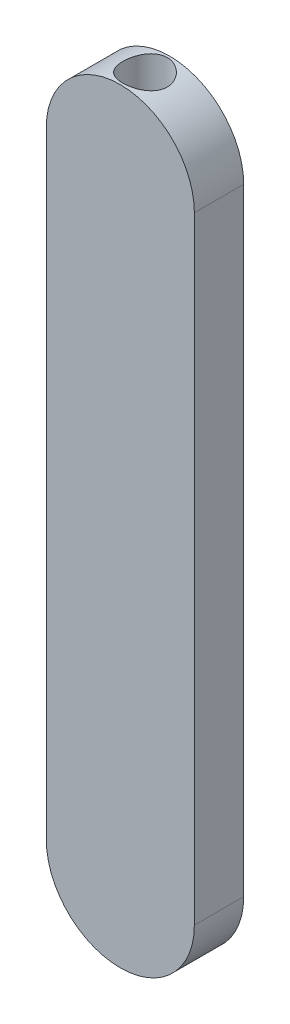
ISO-10303-21;
HEADER;
FILE_DESCRIPTION(('STEP AP214'),'2;1');
FILE_NAME('part.step','',(''),(''),'','','');
FILE_SCHEMA(('AUTOMOTIVE_DESIGN { 1 0 10303 214 1 1 1 1 }'));
ENDSEC;
DATA;
#1=APPLICATION_CONTEXT('core data for automotive mechanical design processes');
#2=APPLICATION_PROTOCOL_DEFINITION('international standard','automotive_design',2000,#1);
#3=PRODUCT_CONTEXT('',#1,'mechanical');
#4=PRODUCT('Part','Part','',(#3));
#5=PRODUCT_RELATED_PRODUCT_CATEGORY('part','',(#4));
#6=PRODUCT_DEFINITION_FORMATION('','',#4);
#7=PRODUCT_DEFINITION_CONTEXT('part definition',#1,'design');
#8=PRODUCT_DEFINITION('design','',#6,#7);
#9=PRODUCT_DEFINITION_SHAPE('','',#8);
#10=(LENGTH_UNIT() NAMED_UNIT(*) SI_UNIT(.MILLI.,.METRE.));
#11=(NAMED_UNIT(*) PLANE_ANGLE_UNIT() SI_UNIT($,.RADIAN.));
#12=(NAMED_UNIT(*) SI_UNIT($,.STERADIAN.) SOLID_ANGLE_UNIT());
#13=UNCERTAINTY_MEASURE_WITH_UNIT(LENGTH_MEASURE(1.E-05),#10,'distance_accuracy_value','');
#14=(GEOMETRIC_REPRESENTATION_CONTEXT(3) GLOBAL_UNCERTAINTY_ASSIGNED_CONTEXT((#13)) GLOBAL_UNIT_ASSIGNED_CONTEXT((#10,
#11,#12)) REPRESENTATION_CONTEXT('',''));
#15=CARTESIAN_POINT('',(0.,0.,0.));
#16=DIRECTION('',(0.,0.,1.));
#17=DIRECTION('',(1.,0.,0.));
#18=AXIS2_PLACEMENT_3D('',#15,#16,#17);
#19=CARTESIAN_POINT('',(0.,125.,10.));
#20=DIRECTION('',(0.,0.,-1.));
#21=DIRECTION('',(-1.,0.,0.));
#22=AXIS2_PLACEMENT_3D('',#19,#20,#21);
#23=CYLINDRICAL_SURFACE('',#22,30.);
#24=CARTESIAN_POINT('',(0.,125.,-10.));
#25=DIRECTION('',(0.,0.,1.));
#26=DIRECTION('',(1.,0.,0.));
#27=AXIS2_PLACEMENT_3D('',#24,#25,#26);
#28=CIRCLE('',#27,30.);
#29=CARTESIAN_POINT('',(30.,125.,-10.));
#30=VERTEX_POINT('',#29);
#31=CARTESIAN_POINT('',(-30.,125.,-10.));
#32=VERTEX_POINT('',#31);
#33=EDGE_CURVE('E120',#30,#32,#28,.T.);
#34=ORIENTED_EDGE('',*,*,#33,.T.);
#35=DIRECTION('',(0.,0.,-1.));
#36=VECTOR('',#35,1.);
#37=CARTESIAN_POINT('',(-30.,125.,10.));
#38=LINE('',#37,#36);
#39=CARTESIAN_POINT('',(-30.,125.,10.));
#40=VERTEX_POINT('',#39);
#41=EDGE_CURVE('E11',#40,#32,#38,.T.);
#42=ORIENTED_EDGE('',*,*,#41,.F.);
#43=CARTESIAN_POINT('',(0.,125.,10.));
#44=DIRECTION('',(0.,0.,1.));
#45=DIRECTION('',(1.,0.,0.));
#46=AXIS2_PLACEMENT_3D('',#43,#44,#45);
#47=CIRCLE('',#46,30.);
#48=CARTESIAN_POINT('',(30.,125.,10.));
#49=VERTEX_POINT('',#48);
#50=EDGE_CURVE('E103',#49,#40,#47,.T.);
#51=ORIENTED_EDGE('',*,*,#50,.F.);
#52=DIRECTION('',(0.,0.,-1.));
#53=VECTOR('',#52,1.);
#54=CARTESIAN_POINT('',(30.,125.,10.));
#55=LINE('',#54,#53);
#56=EDGE_CURVE('E116',#49,#30,#55,.T.);
#57=ORIENTED_EDGE('',*,*,#56,.T.);
#58=EDGE_LOOP('',(#34,#42,#51,#57));
#59=FACE_BOUND('',#58,.T.);
#60=CARTESIAN_POINT('',(0.,155.,-9.));
#61=CARTESIAN_POINT('',(-0.24687522719446,154.999999690804,-8.99999951926633));
#62=CARTESIAN_POINT('',(-0.493758933697373,154.996945376263,-8.98983373748947));
#63=CARTESIAN_POINT('',(-0.98571331633545,154.984811532503,-8.94926216676299));
#64=CARTESIAN_POINT('',(-1.23078390923342,154.975731728377,-8.91885545434272));
#65=CARTESIAN_POINT('',(-1.71734028727223,154.951795867524,-8.83807456534316));
#66=CARTESIAN_POINT('',(-1.95882582561324,154.936939415023,-8.78769902063548));
#67=CARTESIAN_POINT('',(-2.43656882894963,154.901848221789,-8.6674006880664));
#68=CARTESIAN_POINT('',(-2.67282432501111,154.881611491648,-8.59747066925435));
#69=CARTESIAN_POINT('',(-3.13795593973207,154.836349231097,-8.43880923337498));
#70=CARTESIAN_POINT('',(-3.36684511034698,154.81133278546,-8.3501134504766));
#71=CARTESIAN_POINT('',(-3.81629034248756,154.75713676916,-8.15450908614894));
#72=CARTESIAN_POINT('',(-4.03684323307769,154.727955634102,-8.04759365788162));
#73=CARTESIAN_POINT('',(-4.46806405999108,154.666206974297,-7.81640810530772));
#74=CARTESIAN_POINT('',(-4.67873511836349,154.633640529701,-7.69214351228128));
#75=CARTESIAN_POINT('',(-5.08907702569748,154.565935870264,-7.4270444928224));
#76=CARTESIAN_POINT('',(-5.28874277096538,154.530796479525,-7.28620247200257));
#77=CARTESIAN_POINT('',(-5.68079175811243,154.457925648759,-6.98507469473938));
#78=CARTESIAN_POINT('',(-5.87285312608399,154.420150676386,-6.82438029337194));
#79=CARTESIAN_POINT('',(-6.24276841718318,154.343883516478,-6.48770874739904));
#80=CARTESIAN_POINT('',(-6.42062827839696,154.305391637095,-6.31173805520373));
#81=CARTESIAN_POINT('',(-6.76121495469285,154.228692527664,-5.94546427637099));
#82=CARTESIAN_POINT('',(-6.92393310779204,154.190485471909,-5.75515309738337));
#83=CARTESIAN_POINT('',(-7.23301044029676,154.115440036366,-5.36154377643514));
#84=CARTESIAN_POINT('',(-7.37937568089396,154.078601152869,-5.15825049048207));
#85=CARTESIAN_POINT('',(-7.65798662555216,154.006489411854,-4.73506885570751));
#86=CARTESIAN_POINT('',(-7.78983133985887,153.971271875173,-4.51490677567574));
#87=CARTESIAN_POINT('',(-8.03438843056108,153.904405819866,-4.06379176598789));
#88=CARTESIAN_POINT('',(-8.14710828969498,153.872755907015,-3.83284310197441));
#89=CARTESIAN_POINT('',(-8.3525651866136,153.813991056005,-3.36165307045628));
#90=CARTESIAN_POINT('',(-8.44530186155833,153.786876200192,-3.12141153431188));
#91=CARTESIAN_POINT('',(-8.6099761042191,153.738053121907,-2.63336852321781));
#92=CARTESIAN_POINT('',(-8.68191441283536,153.716344706847,-2.38556731791398));
#93=CARTESIAN_POINT('',(-8.80260979417984,153.679573408675,-1.89128494977476));
#94=CARTESIAN_POINT('',(-8.85195939944504,153.664341510447,-1.64496100852945));
#95=CARTESIAN_POINT('',(-8.92991899386314,153.640150467133,-1.14874635011902));
#96=CARTESIAN_POINT('',(-8.958529337725,153.631191214764,-0.898855694030882));
#97=CARTESIAN_POINT('',(-8.99473123894795,153.619838773049,-0.397460111825584));
#98=CARTESIAN_POINT('',(-9.00232721556962,153.617444203171,-0.145955536263609));
#99=CARTESIAN_POINT('',(-8.99643811389517,153.619296153187,0.356779194810821));
#100=CARTESIAN_POINT('',(-8.98295349026987,153.623542529847,0.60800935612495));
#101=CARTESIAN_POINT('',(-8.93590903357945,153.638262955357,1.09916630378445));
#102=CARTESIAN_POINT('',(-8.90309651768086,153.648505090203,1.33917208915314));
#103=CARTESIAN_POINT('',(-8.81829693839761,153.674720691197,1.81554089014339));
#104=CARTESIAN_POINT('',(-8.7663030429288,153.69069619942,2.05190257650946));
#105=CARTESIAN_POINT('',(-8.64359525627879,153.727902191809,2.51925058342802));
#106=CARTESIAN_POINT('',(-8.5728840047393,153.749131934961,2.75023765694972));
#107=CARTESIAN_POINT('',(-8.41330748035027,153.796235375053,3.20537304493311));
#108=CARTESIAN_POINT('',(-8.32444120493493,153.822109328448,3.42952098093452));
#109=CARTESIAN_POINT('',(-8.12789997921522,153.878154720427,3.8725664168717));
#110=CARTESIAN_POINT('',(-8.01998497142832,153.908379971791,4.09135056999753));
#111=CARTESIAN_POINT('',(-7.78698416863509,153.972011583606,4.51909231090593));
#112=CARTESIAN_POINT('',(-7.66189790363685,154.005418031121,4.72804962950943));
#113=CARTESIAN_POINT('',(-7.39538391059137,154.074511931035,5.13492478845818));
#114=CARTESIAN_POINT('',(-7.25395309727253,154.110199813518,5.33284053405679));
#115=CARTESIAN_POINT('',(-6.95567501480212,154.182908431969,5.71643405375052));
#116=CARTESIAN_POINT('',(-6.79882730322162,154.219929206168,5.90211147637878));
#117=CARTESIAN_POINT('',(-6.46380880146505,154.295902260877,6.26762912592172));
#118=CARTESIAN_POINT('',(-6.28502066721601,154.334870581416,6.44690070087367));
#119=CARTESIAN_POINT('',(-5.91290332936832,154.412134875664,6.78981528813084));
#120=CARTESIAN_POINT('',(-5.71957407379525,154.45043084697,6.95345824456986));
#121=CARTESIAN_POINT('',(-5.3195794785746,154.525302203701,7.26403410984884));
#122=CARTESIAN_POINT('',(-5.11291276619929,154.561877411348,7.41096529435441));
#123=CARTESIAN_POINT('',(-4.6875944702094,154.632295088259,7.68704973774021));
#124=CARTESIAN_POINT('',(-4.46894340179161,154.666137674842,7.81620376000803));
#125=CARTESIAN_POINT('',(-4.01951930468406,154.730377401638,8.05660330017718));
#126=CARTESIAN_POINT('',(-3.78867237370753,154.760748868096,8.16771764646381));
#127=CARTESIAN_POINT('',(-3.31796148225631,154.816895892795,8.369989427077));
#128=CARTESIAN_POINT('',(-3.07810121716819,154.842673310192,8.46115493786864));
#129=CARTESIAN_POINT('',(-2.59100646332482,154.888903081017,8.62279127227451));
#130=CARTESIAN_POINT('',(-2.34377211625549,154.909355536687,8.69326249322791));
#131=CARTESIAN_POINT('',(-1.84378416239139,154.944335848342,8.8128613614019));
#132=CARTESIAN_POINT('',(-1.59103075750432,154.958863920681,8.86198978805205));
#133=CARTESIAN_POINT('',(-1.09110687447902,154.981157940997,8.9370613874282));
#134=CARTESIAN_POINT('',(-0.844061604560787,154.989147872582,8.96377341231346));
#135=CARTESIAN_POINT('',(-0.348488409261118,154.998999493918,8.99667826532353));
#136=CARTESIAN_POINT('',(-0.0999605195231613,155.000861330404,9.0028715847604));
#137=CARTESIAN_POINT('',(0.396693900528415,154.998404909285,8.9946823962975));
#138=CARTESIAN_POINT('',(0.644820475666576,154.994087397612,8.98030237187826));
#139=CARTESIAN_POINT('',(1.13885569360233,154.97939423655,8.93110458913962));
#140=CARTESIAN_POINT('',(1.38476435207486,154.96901863001,8.89628697537629));
#141=CARTESIAN_POINT('',(1.86699068629302,154.942800902787,8.80755783222827));
#142=CARTESIAN_POINT('',(2.10339917366125,154.927088920447,8.75410012033345));
#143=CARTESIAN_POINT('',(2.57085342622231,154.890562008373,8.62840150170935));
#144=CARTESIAN_POINT('',(2.80189723737997,154.869745250226,8.55615386429563));
#145=CARTESIAN_POINT('',(3.25694777313326,154.823557533001,8.39348911553929));
#146=CARTESIAN_POINT('',(3.4809564814769,154.798187871541,8.30307718030838));
#147=CARTESIAN_POINT('',(3.9206735334169,154.743527531497,8.10472197538234));
#148=CARTESIAN_POINT('',(4.13637865624372,154.714235350799,7.99677198616619));
#149=CARTESIAN_POINT('',(4.56288021690551,154.651772756751,7.76149330417735));
#150=CARTESIAN_POINT('',(4.77345386566451,154.618529364886,7.63378013243341));
#151=CARTESIAN_POINT('',(5.1832482000316,154.549570858058,7.36168864950443));
#152=CARTESIAN_POINT('',(5.38246373149598,154.513854636987,7.21730286104145));
#153=CARTESIAN_POINT('',(5.76824209562065,154.440888680009,6.91286909678906));
#154=CARTESIAN_POINT('',(5.95480494100446,154.403638945643,6.75282113674989));
#155=CARTESIAN_POINT('',(6.31416336644096,154.328570417492,6.41807164510148));
#156=CARTESIAN_POINT('',(6.48695868128923,154.290751612762,6.24336983134755));
#157=CARTESIAN_POINT('',(6.82378475322263,154.214155429841,5.87373335172453));
#158=CARTESIAN_POINT('',(6.98726403029261,154.175393563162,5.67829245590589));
#159=CARTESIAN_POINT('',(7.29714192683922,154.099435878477,5.27413861942092));
#160=CARTESIAN_POINT('',(7.44354675134784,154.062239494719,5.06543054305524));
#161=CARTESIAN_POINT('',(7.71836315758023,153.9904649038,4.63593471765456));
#162=CARTESIAN_POINT('',(7.84676762786344,153.955887733883,4.41514224203838));
#163=CARTESIAN_POINT('',(8.08449235365031,153.890416862031,3.96310073693768));
#164=CARTESIAN_POINT('',(8.19382047882574,153.859521642836,3.73185606916012));
#165=CARTESIAN_POINT('',(8.39212213615004,153.802480643849,3.26146280739651));
#166=CARTESIAN_POINT('',(8.48118472093344,153.776314193186,3.02235429420191));
#167=CARTESIAN_POINT('',(8.63880815166785,153.729388515714,2.53694818381532));
#168=CARTESIAN_POINT('',(8.70736898436385,153.708629292401,2.29065058197546));
#169=CARTESIAN_POINT('',(8.82333878587885,153.67319958287,1.79276527738367));
#170=CARTESIAN_POINT('',(8.8707538278203,153.658527348538,1.54117911528366));
#171=CARTESIAN_POINT('',(8.94399853503101,153.635753328123,1.03459227418198));
#172=CARTESIAN_POINT('',(8.96982902277117,153.627651291686,0.779591725660376));
#173=CARTESIAN_POINT('',(8.99902686177176,153.618485863641,0.27886553863208));
#174=CARTESIAN_POINT('',(9.00328608012112,153.61714302695,0.03319659601729));
#175=CARTESIAN_POINT('',(8.99170957250374,153.620782612131,-0.457615566175719));
#176=CARTESIAN_POINT('',(8.97587443373626,153.62576484917,-0.702758800906539));
#177=CARTESIAN_POINT('',(8.92425831634993,153.641898343331,-1.19071618682869));
#178=CARTESIAN_POINT('',(8.88847824348013,153.653049320315,-1.4335304432754));
#179=CARTESIAN_POINT('',(8.79729759590076,153.681175475724,-1.91510106215879));
#180=CARTESIAN_POINT('',(8.74189693009455,153.698150681189,-2.15385740574956));
#181=CARTESIAN_POINT('',(8.61278136684695,153.737161994499,-2.62266336729945));
#182=CARTESIAN_POINT('',(8.53930707566763,153.759131347168,-2.85278492785691));
#183=CARTESIAN_POINT('',(8.37426393967971,153.807622213489,-3.30603927141137));
#184=CARTESIAN_POINT('',(8.28268862083896,153.834145355408,-3.52916952071281));
#185=CARTESIAN_POINT('',(8.08215610506225,153.890995244476,-3.96695328366282));
#186=CARTESIAN_POINT('',(7.97319984049174,153.921321787581,-4.18160725123416));
#187=CARTESIAN_POINT('',(7.73866416062295,153.984958783846,-4.60117873107889));
#188=CARTESIAN_POINT('',(7.61308375480259,154.01826941477,-4.80609566219755));
#189=CARTESIAN_POINT('',(7.34126486815788,154.088248997366,-5.21226415946834));
#190=CARTESIAN_POINT('',(7.19444058113146,154.124996076204,-5.41311041005077));
#191=CARTESIAN_POINT('',(6.8848048622528,154.199740080473,-5.80182818742272));
#192=CARTESIAN_POINT('',(6.72199309309908,154.237737032263,-5.98969944032521));
#193=CARTESIAN_POINT('',(6.38137449598392,154.313964546973,-6.35136039376972));
#194=CARTESIAN_POINT('',(6.20356384484473,154.352195167138,-6.5251464817687));
#195=CARTESIAN_POINT('',(5.8340876381612,154.427860521655,-6.8574895356109));
#196=CARTESIAN_POINT('',(5.64242232618264,154.465295269984,-7.01604676906422));
#197=CARTESIAN_POINT('',(5.24055724419363,154.539456998815,-7.3213452270685));
#198=CARTESIAN_POINT('',(5.02997746430738,154.576130506387,-7.46759977741498));
#199=CARTESIAN_POINT('',(4.59683195296546,154.646538636923,-7.74175722586798));
#200=CARTESIAN_POINT('',(4.37427060922232,154.680274324043,-7.86966677997631));
#201=CARTESIAN_POINT('',(3.91863702485825,154.743859520223,-8.10618008273968));
#202=CARTESIAN_POINT('',(3.68556689736798,154.773709805919,-8.21478769116109));
#203=CARTESIAN_POINT('',(3.21051695796145,154.8286729272,-8.41181832037685));
#204=CARTESIAN_POINT('',(2.96853800844563,154.853786219907,-8.50024328897563));
#205=CARTESIAN_POINT('',(2.50382115734948,154.89614249473,-8.64776090442864));
#206=CARTESIAN_POINT('',(2.28180743967457,154.913941034826,-8.70898372495703));
#207=CARTESIAN_POINT('',(1.83334279623095,154.944772103142,-8.81430188411468));
#208=CARTESIAN_POINT('',(1.60689045524053,154.957803084336,-8.85839166352448));
#209=CARTESIAN_POINT('',(1.15106718653289,154.97877731236,-8.92906654858351));
#210=CARTESIAN_POINT('',(0.921696658553534,154.986721248529,-8.95565402596193));
#211=CARTESIAN_POINT('',(0.461552874118431,154.997331805047,-8.99111784909154));
#212=CARTESIAN_POINT('',(0.230780141923343,155.000000289037,-9.00000044939213));
#213=CARTESIAN_POINT('',(0.,155.,-9.));
#214=B_SPLINE_CURVE_WITH_KNOTS('',3,(#60,#61,#62,#63,#64,#65,#66,#67,#68,#69,#70,#71,#72,#73,
#74,#75,#76,#77,#78,#79,#80,#81,#82,#83,#84,#85,#86,#87,#88,#89,#90,#91,#92,#93,#94,#95,#96,#97,
#98,#99,#100,#101,#102,#103,#104,#105,#106,#107,#108,#109,#110,#111,#112,#113,#114,#115,#116,
#117,#118,#119,#120,#121,#122,#123,#124,#125,#126,#127,#128,#129,#130,#131,#132,#133,#134,#135,
#136,#137,#138,#139,#140,#141,#142,#143,#144,#145,#146,#147,#148,#149,#150,#151,#152,#153,#154,
#155,#156,#157,#158,#159,#160,#161,#162,#163,#164,#165,#166,#167,#168,#169,#170,#171,#172,#173,
#174,#175,#176,#177,#178,#179,#180,#181,#182,#183,#184,#185,#186,#187,#188,#189,#190,#191,#192,
#193,#194,#195,#196,#197,#198,#199,#200,#201,#202,#203,#204,#205,#206,#207,#208,#209,#210,#211,
#212,#213),.UNSPECIFIED.,.T.,.F.,(4,2,2,2,2,2,2,2,2,2,2,2,2,2,2,2,2,2,2,2,2,2,2,2,2,2,2,2,2,2,2,
2,2,2,2,2,2,2,2,2,2,2,2,2,2,2,2,2,2,2,2,2,2,2,2,2,2,2,2,2,2,2,2,2,2,2,2,2,2,2,2,2,2,2,2,2,4),
(0.,0.740413216901878,1.4808602166743,2.22135795560235,2.96212988240107,3.70150758898388,
4.44116376467173,5.18058465858264,5.92034562132776,6.67923780992289,7.4378110023569,
8.19681551108569,8.95553775562747,9.73166741230633,10.507492698835,11.2833320710433,
12.0591438021185,12.8132385740861,13.5673204482712,14.321243729163,15.0751507495034,
15.8016616365828,16.5284315448307,17.2550990138762,17.9818066221682,18.7184283271017,
19.4550701980193,20.1918513486502,20.9286536493539,21.6962623628207,22.4638738200863,
23.2315644084216,23.9992220202666,24.7722331237348,25.5449306852944,26.3176134097617,
27.0902679138193,27.8351912450428,28.5800967392512,29.32491232089,30.0697226344752,
30.797537709847,31.5256138536762,32.2534828179172,32.9816313180365,33.7263192489373,
34.4713424616101,35.2163649250774,35.9614017364707,36.7336800097587,37.5056767488153,
38.2779776279686,39.0499591483441,39.8184798678771,40.5870010842806,41.3553014371578,
42.1235725129188,42.8598040112379,43.5960139958236,44.3321905500058,45.0683705222341,
45.7952353579563,46.5223606368482,47.2494469236927,47.9765765522915,48.7301889381114,
49.483817226949,50.2376381976291,50.9914459193129,51.7674951526374,52.5432621006114,
53.3188737452504,54.0944105047804,54.7866663836971,55.4791466941857,56.1715331476467,
56.8636749604173),.UNSPECIFIED.);
#215=CARTESIAN_POINT('',(0.,155.,-9.));
#216=VERTEX_POINT('',#215);
#217=EDGE_CURVE('E49',#216,#216,#214,.T.);
#218=ORIENTED_EDGE('',*,*,#217,.F.);
#219=EDGE_LOOP('',(#218));
#220=FACE_BOUND('',#219,.T.);
#221=ADVANCED_FACE('F45',(#59,#220),#23,.T.);
#222=CARTESIAN_POINT('',(-30.,-125.,10.));
#223=DIRECTION('',(1.,0.,0.));
#224=DIRECTION('',(0.,0.,-1.));
#225=AXIS2_PLACEMENT_3D('',#222,#223,#224);
#226=PLANE('',#225);
#227=DIRECTION('',(0.,-1.,0.));
#228=VECTOR('',#227,1.);
#229=CARTESIAN_POINT('',(-30.,-125.,-10.));
#230=LINE('',#229,#228);
#231=CARTESIAN_POINT('',(-30.,-125.,-10.));
#232=VERTEX_POINT('',#231);
#233=EDGE_CURVE('E108',#32,#232,#230,.T.);
#234=ORIENTED_EDGE('',*,*,#233,.T.);
#235=DIRECTION('',(0.,0.,-1.));
#236=VECTOR('',#235,1.);
#237=CARTESIAN_POINT('',(-30.,-125.,10.));
#238=LINE('',#237,#236);
#239=CARTESIAN_POINT('',(-30.,-125.,10.));
#240=VERTEX_POINT('',#239);
#241=EDGE_CURVE('E60',#240,#232,#238,.T.);
#242=ORIENTED_EDGE('',*,*,#241,.F.);
#243=DIRECTION('',(0.,-1.,0.));
#244=VECTOR('',#243,1.);
#245=CARTESIAN_POINT('',(-30.,-125.,10.));
#246=LINE('',#245,#244);
#247=EDGE_CURVE('E98',#40,#240,#246,.T.);
#248=ORIENTED_EDGE('',*,*,#247,.F.);
#249=ORIENTED_EDGE('',*,*,#41,.T.);
#250=EDGE_LOOP('',(#234,#242,#248,#249));
#251=FACE_BOUND('',#250,.T.);
#252=ADVANCED_FACE('F107',(#251),#226,.F.);
#253=CARTESIAN_POINT('',(0.,-125.,10.));
#254=DIRECTION('',(0.,0.,-1.));
#255=DIRECTION('',(-1.,0.,0.));
#256=AXIS2_PLACEMENT_3D('',#253,#254,#255);
#257=CYLINDRICAL_SURFACE('',#256,30.);
#258=CARTESIAN_POINT('',(0.,-125.,-10.));
#259=DIRECTION('',(0.,0.,1.));
#260=DIRECTION('',(1.,0.,0.));
#261=AXIS2_PLACEMENT_3D('',#258,#259,#260);
#262=CIRCLE('',#261,30.);
#263=CARTESIAN_POINT('',(30.,-125.,-10.));
#264=VERTEX_POINT('',#263);
#265=EDGE_CURVE('E85',#232,#264,#262,.T.);
#266=ORIENTED_EDGE('',*,*,#265,.T.);
#267=DIRECTION('',(0.,0.,-1.));
#268=VECTOR('',#267,1.);
#269=CARTESIAN_POINT('',(30.,-125.,10.));
#270=LINE('',#269,#268);
#271=CARTESIAN_POINT('',(30.,-125.,10.));
#272=VERTEX_POINT('',#271);
#273=EDGE_CURVE('E110',#272,#264,#270,.T.);
#274=ORIENTED_EDGE('',*,*,#273,.F.);
#275=CARTESIAN_POINT('',(0.,-125.,10.));
#276=DIRECTION('',(0.,0.,1.));
#277=DIRECTION('',(1.,0.,0.));
#278=AXIS2_PLACEMENT_3D('',#275,#276,#277);
#279=CIRCLE('',#278,30.);
#280=EDGE_CURVE('E101',#240,#272,#279,.T.);
#281=ORIENTED_EDGE('',*,*,#280,.F.);
#282=ORIENTED_EDGE('',*,*,#241,.T.);
#283=EDGE_LOOP('',(#266,#274,#281,#282));
#284=FACE_BOUND('',#283,.T.);
#285=ADVANCED_FACE('F112',(#284),#257,.T.);
#286=CARTESIAN_POINT('',(30.,-125.,10.));
#287=DIRECTION('',(-1.,0.,0.));
#288=DIRECTION('',(0.,0.,1.));
#289=AXIS2_PLACEMENT_3D('',#286,#287,#288);
#290=PLANE('',#289);
#291=DIRECTION('',(0.,1.,0.));
#292=VECTOR('',#291,1.);
#293=CARTESIAN_POINT('',(30.,-125.,-10.));
#294=LINE('',#293,#292);
#295=EDGE_CURVE('E91',#264,#30,#294,.T.);
#296=ORIENTED_EDGE('',*,*,#295,.T.);
#297=ORIENTED_EDGE('',*,*,#56,.F.);
#298=DIRECTION('',(0.,1.,0.));
#299=VECTOR('',#298,1.);
#300=CARTESIAN_POINT('',(30.,-125.,10.));
#301=LINE('',#300,#299);
#302=EDGE_CURVE('E68',#272,#49,#301,.T.);
#303=ORIENTED_EDGE('',*,*,#302,.F.);
#304=ORIENTED_EDGE('',*,*,#273,.T.);
#305=EDGE_LOOP('',(#296,#297,#303,#304));
#306=FACE_BOUND('',#305,.T.);
#307=ADVANCED_FACE('F133',(#306),#290,.F.);
#308=CARTESIAN_POINT('',(0.,125.,10.));
#309=DIRECTION('',(0.,0.,1.));
#310=DIRECTION('',(1.,0.,0.));
#311=AXIS2_PLACEMENT_3D('',#308,#309,#310);
#312=PLANE('',#311);
#313=ORIENTED_EDGE('',*,*,#50,.T.);
#314=ORIENTED_EDGE('',*,*,#247,.T.);
#315=ORIENTED_EDGE('',*,*,#280,.T.);
#316=ORIENTED_EDGE('',*,*,#302,.T.);
#317=EDGE_LOOP('',(#313,#314,#315,#316));
#318=FACE_BOUND('',#317,.T.);
#319=ADVANCED_FACE('F99',(#318),#312,.T.);
#320=CARTESIAN_POINT('',(0.,125.,-10.));
#321=DIRECTION('',(0.,0.,1.));
#322=DIRECTION('',(1.,0.,0.));
#323=AXIS2_PLACEMENT_3D('',#320,#321,#322);
#324=PLANE('',#323);
#325=ORIENTED_EDGE('',*,*,#33,.F.);
#326=ORIENTED_EDGE('',*,*,#295,.F.);
#327=ORIENTED_EDGE('',*,*,#265,.F.);
#328=ORIENTED_EDGE('',*,*,#233,.F.);
#329=EDGE_LOOP('',(#325,#326,#327,#328));
#330=FACE_BOUND('',#329,.T.);
#331=ADVANCED_FACE('F136',(#330),#324,.F.);
#332=CARTESIAN_POINT('',(0.,165.,0.));
#333=DIRECTION('',(0.,-1.,0.));
#334=DIRECTION('',(0.,0.,-1.));
#335=AXIS2_PLACEMENT_3D('',#332,#333,#334);
#336=CYLINDRICAL_SURFACE('',#335,9.);
#337=CARTESIAN_POINT('',(0.,125.,0.));
#338=DIRECTION('',(0.,1.,0.));
#339=DIRECTION('',(0.,0.,1.));
#340=AXIS2_PLACEMENT_3D('',#337,#338,#339);
#341=CIRCLE('',#340,9.);
#342=CARTESIAN_POINT('',(0.,125.,9.));
#343=VERTEX_POINT('',#342);
#344=EDGE_CURVE('E141',#343,#343,#341,.T.);
#345=ORIENTED_EDGE('',*,*,#344,.F.);
#346=EDGE_LOOP('',(#345));
#347=FACE_BOUND('',#346,.T.);
#348=ORIENTED_EDGE('',*,*,#217,.T.);
#349=EDGE_LOOP('',(#348));
#350=FACE_BOUND('',#349,.T.);
#351=ADVANCED_FACE('F150',(#347,#350),#336,.F.);
#352=CARTESIAN_POINT('',(0.,125.,0.));
#353=DIRECTION('',(0.,1.,0.));
#354=DIRECTION('',(0.,0.,1.));
#355=AXIS2_PLACEMENT_3D('',#352,#353,#354);
#356=PLANE('',#355);
#357=ORIENTED_EDGE('',*,*,#344,.T.);
#358=EDGE_LOOP('',(#357));
#359=FACE_BOUND('',#358,.T.);
#360=ADVANCED_FACE('F168',(#359),#356,.T.);
#361=CLOSED_SHELL('',(#221,#252,#285,#307,#319,#331,#351,#360));
#362=MANIFOLD_SOLID_BREP('B2',#361);
#363=ADVANCED_BREP_SHAPE_REPRESENTATION('',(#18,#362),#14);
#364=SHAPE_DEFINITION_REPRESENTATION(#9,#363);
ENDSEC;
END-ISO-10303-21;
